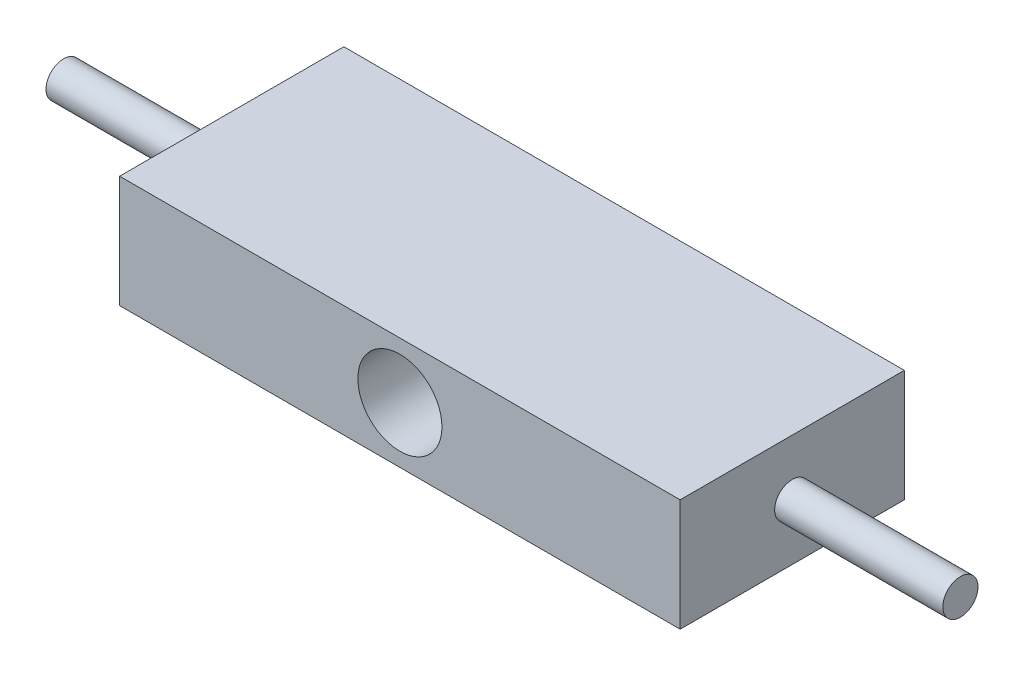
ISO-10303-21;
HEADER;
FILE_DESCRIPTION(('STEP AP214'),'2;1');
FILE_NAME('part.step','',(''),(''),'','','');
FILE_SCHEMA(('AUTOMOTIVE_DESIGN { 1 0 10303 214 1 1 1 1 }'));
ENDSEC;
DATA;
#1=APPLICATION_CONTEXT('core data for automotive mechanical design processes');
#2=APPLICATION_PROTOCOL_DEFINITION('international standard','automotive_design',2000,#1);
#3=PRODUCT_CONTEXT('',#1,'mechanical');
#4=PRODUCT('Part','Part','',(#3));
#5=PRODUCT_RELATED_PRODUCT_CATEGORY('part','',(#4));
#6=PRODUCT_DEFINITION_FORMATION('','',#4);
#7=PRODUCT_DEFINITION_CONTEXT('part definition',#1,'design');
#8=PRODUCT_DEFINITION('design','',#6,#7);
#9=PRODUCT_DEFINITION_SHAPE('','',#8);
#10=(LENGTH_UNIT() NAMED_UNIT(*) SI_UNIT(.MILLI.,.METRE.));
#11=(NAMED_UNIT(*) PLANE_ANGLE_UNIT() SI_UNIT($,.RADIAN.));
#12=(NAMED_UNIT(*) SI_UNIT($,.STERADIAN.) SOLID_ANGLE_UNIT());
#13=UNCERTAINTY_MEASURE_WITH_UNIT(LENGTH_MEASURE(1.E-05),#10,'distance_accuracy_value','');
#14=(GEOMETRIC_REPRESENTATION_CONTEXT(3) GLOBAL_UNCERTAINTY_ASSIGNED_CONTEXT((#13)) GLOBAL_UNIT_ASSIGNED_CONTEXT((#10,
#11,#12)) REPRESENTATION_CONTEXT('',''));
#15=CARTESIAN_POINT('',(0.,0.,0.));
#16=DIRECTION('',(0.,0.,1.));
#17=DIRECTION('',(1.,0.,0.));
#18=AXIS2_PLACEMENT_3D('',#15,#16,#17);
#19=CARTESIAN_POINT('',(31.75,6.35,-25.4));
#20=DIRECTION('',(1.,0.,0.));
#21=DIRECTION('',(0.,0.,-1.));
#22=AXIS2_PLACEMENT_3D('',#19,#20,#21);
#23=PLANE('',#22);
#24=CARTESIAN_POINT('',(31.75,0.,-12.7));
#25=DIRECTION('',(1.,0.,0.));
#26=DIRECTION('',(0.,0.,-1.));
#27=AXIS2_PLACEMENT_3D('',#24,#25,#26);
#28=CIRCLE('',#27,1.9939);
#29=CARTESIAN_POINT('',(31.75,0.,-14.6939));
#30=VERTEX_POINT('',#29);
#31=EDGE_CURVE('E161',#30,#30,#28,.T.);
#32=ORIENTED_EDGE('',*,*,#31,.F.);
#33=EDGE_LOOP('',(#32));
#34=FACE_BOUND('',#33,.T.);
#35=DIRECTION('',(0.,1.,0.));
#36=VECTOR('',#35,1.);
#37=CARTESIAN_POINT('',(31.75,6.35,0.));
#38=LINE('',#37,#36);
#39=CARTESIAN_POINT('',(31.75,-6.35,0.));
#40=VERTEX_POINT('',#39);
#41=CARTESIAN_POINT('',(31.75,6.35,0.));
#42=VERTEX_POINT('',#41);
#43=EDGE_CURVE('E103',#40,#42,#38,.T.);
#44=ORIENTED_EDGE('',*,*,#43,.F.);
#45=DIRECTION('',(0.,0.,1.));
#46=VECTOR('',#45,1.);
#47=CARTESIAN_POINT('',(31.75,-6.35,-25.4));
#48=LINE('',#47,#46);
#49=CARTESIAN_POINT('',(31.75,-6.35,-25.4));
#50=VERTEX_POINT('',#49);
#51=EDGE_CURVE('E11',#50,#40,#48,.T.);
#52=ORIENTED_EDGE('',*,*,#51,.F.);
#53=DIRECTION('',(0.,1.,0.));
#54=VECTOR('',#53,1.);
#55=CARTESIAN_POINT('',(31.75,6.35,-25.4));
#56=LINE('',#55,#54);
#57=CARTESIAN_POINT('',(31.75,6.35,-25.4));
#58=VERTEX_POINT('',#57);
#59=EDGE_CURVE('E96',#50,#58,#56,.T.);
#60=ORIENTED_EDGE('',*,*,#59,.T.);
#61=DIRECTION('',(0.,0.,1.));
#62=VECTOR('',#61,1.);
#63=CARTESIAN_POINT('',(31.75,6.35,-25.4));
#64=LINE('',#63,#62);
#65=EDGE_CURVE('E41',#58,#42,#64,.T.);
#66=ORIENTED_EDGE('',*,*,#65,.T.);
#67=EDGE_LOOP('',(#44,#52,#60,#66));
#68=FACE_BOUND('',#67,.T.);
#69=ADVANCED_FACE('F38',(#34,#68),#23,.T.);
#70=CARTESIAN_POINT('',(-31.75,-6.35,-25.4));
#71=DIRECTION('',(0.,-1.,0.));
#72=DIRECTION('',(0.,0.,-1.));
#73=AXIS2_PLACEMENT_3D('',#70,#71,#72);
#74=PLANE('',#73);
#75=DIRECTION('',(1.,0.,0.));
#76=VECTOR('',#75,1.);
#77=CARTESIAN_POINT('',(-31.75,-6.35,0.));
#78=LINE('',#77,#76);
#79=CARTESIAN_POINT('',(-31.75,-6.35,0.));
#80=VERTEX_POINT('',#79);
#81=EDGE_CURVE('E98',#80,#40,#78,.T.);
#82=ORIENTED_EDGE('',*,*,#81,.F.);
#83=DIRECTION('',(0.,0.,1.));
#84=VECTOR('',#83,1.);
#85=CARTESIAN_POINT('',(-31.75,-6.35,-25.4));
#86=LINE('',#85,#84);
#87=CARTESIAN_POINT('',(-31.75,-6.35,-25.4));
#88=VERTEX_POINT('',#87);
#89=EDGE_CURVE('E47',#88,#80,#86,.T.);
#90=ORIENTED_EDGE('',*,*,#89,.F.);
#91=DIRECTION('',(1.,0.,0.));
#92=VECTOR('',#91,1.);
#93=CARTESIAN_POINT('',(-31.75,-6.35,-25.4));
#94=LINE('',#93,#92);
#95=EDGE_CURVE('E93',#88,#50,#94,.T.);
#96=ORIENTED_EDGE('',*,*,#95,.T.);
#97=ORIENTED_EDGE('',*,*,#51,.T.);
#98=EDGE_LOOP('',(#82,#90,#96,#97));
#99=FACE_BOUND('',#98,.T.);
#100=ADVANCED_FACE('F114',(#99),#74,.T.);
#101=CARTESIAN_POINT('',(-31.75,6.35,-25.4));
#102=DIRECTION('',(-1.,0.,0.));
#103=DIRECTION('',(0.,0.,1.));
#104=AXIS2_PLACEMENT_3D('',#101,#102,#103);
#105=PLANE('',#104);
#106=CARTESIAN_POINT('',(-31.75,0.,-12.7));
#107=DIRECTION('',(-1.,0.,0.));
#108=DIRECTION('',(0.,0.,1.));
#109=AXIS2_PLACEMENT_3D('',#106,#107,#108);
#110=CIRCLE('',#109,1.9939);
#111=CARTESIAN_POINT('',(-31.75,0.,-10.7061));
#112=VERTEX_POINT('',#111);
#113=EDGE_CURVE('E162',#112,#112,#110,.T.);
#114=ORIENTED_EDGE('',*,*,#113,.F.);
#115=EDGE_LOOP('',(#114));
#116=FACE_BOUND('',#115,.T.);
#117=DIRECTION('',(0.,-1.,0.));
#118=VECTOR('',#117,1.);
#119=CARTESIAN_POINT('',(-31.75,6.35,0.));
#120=LINE('',#119,#118);
#121=CARTESIAN_POINT('',(-31.75,6.35,0.));
#122=VERTEX_POINT('',#121);
#123=EDGE_CURVE('E88',#122,#80,#120,.T.);
#124=ORIENTED_EDGE('',*,*,#123,.F.);
#125=DIRECTION('',(0.,0.,1.));
#126=VECTOR('',#125,1.);
#127=CARTESIAN_POINT('',(-31.75,6.35,-25.4));
#128=LINE('',#127,#126);
#129=CARTESIAN_POINT('',(-31.75,6.35,-25.4));
#130=VERTEX_POINT('',#129);
#131=EDGE_CURVE('E83',#130,#122,#128,.T.);
#132=ORIENTED_EDGE('',*,*,#131,.F.);
#133=DIRECTION('',(0.,-1.,0.));
#134=VECTOR('',#133,1.);
#135=CARTESIAN_POINT('',(-31.75,6.35,-25.4));
#136=LINE('',#135,#134);
#137=EDGE_CURVE('E86',#130,#88,#136,.T.);
#138=ORIENTED_EDGE('',*,*,#137,.T.);
#139=ORIENTED_EDGE('',*,*,#89,.T.);
#140=EDGE_LOOP('',(#124,#132,#138,#139));
#141=FACE_BOUND('',#140,.T.);
#142=ADVANCED_FACE('F85',(#116,#141),#105,.T.);
#143=CARTESIAN_POINT('',(-31.75,6.35,-25.4));
#144=DIRECTION('',(0.,1.,0.));
#145=DIRECTION('',(0.,0.,1.));
#146=AXIS2_PLACEMENT_3D('',#143,#144,#145);
#147=PLANE('',#146);
#148=DIRECTION('',(-1.,0.,0.));
#149=VECTOR('',#148,1.);
#150=CARTESIAN_POINT('',(-31.75,6.35,0.));
#151=LINE('',#150,#149);
#152=EDGE_CURVE('E106',#42,#122,#151,.T.);
#153=ORIENTED_EDGE('',*,*,#152,.F.);
#154=ORIENTED_EDGE('',*,*,#65,.F.);
#155=DIRECTION('',(-1.,0.,0.));
#156=VECTOR('',#155,1.);
#157=CARTESIAN_POINT('',(-31.75,6.35,-25.4));
#158=LINE('',#157,#156);
#159=EDGE_CURVE('E92',#58,#130,#158,.T.);
#160=ORIENTED_EDGE('',*,*,#159,.T.);
#161=ORIENTED_EDGE('',*,*,#131,.T.);
#162=EDGE_LOOP('',(#153,#154,#160,#161));
#163=FACE_BOUND('',#162,.T.);
#164=ADVANCED_FACE('F95',(#163),#147,.T.);
#165=CARTESIAN_POINT('',(0.,0.,-25.4));
#166=DIRECTION('',(0.,0.,1.));
#167=DIRECTION('',(1.,0.,0.));
#168=AXIS2_PLACEMENT_3D('',#165,#166,#167);
#169=PLANE('',#168);
#170=CARTESIAN_POINT('',(0.,0.,-25.4));
#171=DIRECTION('',(0.,0.,1.));
#172=DIRECTION('',(1.,0.,0.));
#173=AXIS2_PLACEMENT_3D('',#170,#171,#172);
#174=CIRCLE('',#173,4.7625);
#175=CARTESIAN_POINT('',(4.76249999999999,0.,-25.4));
#176=VERTEX_POINT('',#175);
#177=EDGE_CURVE('E107',#176,#176,#174,.T.);
#178=ORIENTED_EDGE('',*,*,#177,.T.);
#179=EDGE_LOOP('',(#178));
#180=FACE_BOUND('',#179,.T.);
#181=ORIENTED_EDGE('',*,*,#59,.F.);
#182=ORIENTED_EDGE('',*,*,#95,.F.);
#183=ORIENTED_EDGE('',*,*,#137,.F.);
#184=ORIENTED_EDGE('',*,*,#159,.F.);
#185=EDGE_LOOP('',(#181,#182,#183,#184));
#186=FACE_BOUND('',#185,.T.);
#187=ADVANCED_FACE('F91',(#180,#186),#169,.F.);
#188=CARTESIAN_POINT('',(0.,0.,0.));
#189=DIRECTION('',(0.,0.,1.));
#190=DIRECTION('',(1.,0.,0.));
#191=AXIS2_PLACEMENT_3D('',#188,#189,#190);
#192=PLANE('',#191);
#193=CARTESIAN_POINT('',(0.,0.,0.));
#194=DIRECTION('',(0.,0.,1.));
#195=DIRECTION('',(1.,0.,0.));
#196=AXIS2_PLACEMENT_3D('',#193,#194,#195);
#197=CIRCLE('',#196,4.7625);
#198=CARTESIAN_POINT('',(4.76249999999999,0.,0.));
#199=VERTEX_POINT('',#198);
#200=EDGE_CURVE('E171',#199,#199,#197,.T.);
#201=ORIENTED_EDGE('',*,*,#200,.F.);
#202=EDGE_LOOP('',(#201));
#203=FACE_BOUND('',#202,.T.);
#204=ORIENTED_EDGE('',*,*,#43,.T.);
#205=ORIENTED_EDGE('',*,*,#152,.T.);
#206=ORIENTED_EDGE('',*,*,#123,.T.);
#207=ORIENTED_EDGE('',*,*,#81,.T.);
#208=EDGE_LOOP('',(#204,#205,#206,#207));
#209=FACE_BOUND('',#208,.T.);
#210=ADVANCED_FACE('F113',(#203,#209),#192,.T.);
#211=CARTESIAN_POINT('',(0.,0.,-25.4));
#212=DIRECTION('',(0.,0.,1.));
#213=DIRECTION('',(1.,0.,0.));
#214=AXIS2_PLACEMENT_3D('',#211,#212,#213);
#215=CYLINDRICAL_SURFACE('',#214,4.7625);
#216=ORIENTED_EDGE('',*,*,#177,.F.);
#217=EDGE_LOOP('',(#216));
#218=FACE_BOUND('',#217,.T.);
#219=ORIENTED_EDGE('',*,*,#200,.T.);
#220=EDGE_LOOP('',(#219));
#221=FACE_BOUND('',#220,.T.);
#222=ADVANCED_FACE('F134',(#218,#221),#215,.F.);
#223=CARTESIAN_POINT('',(50.8,0.,-12.7));
#224=DIRECTION('',(-1.,0.,0.));
#225=DIRECTION('',(0.,0.,1.));
#226=AXIS2_PLACEMENT_3D('',#223,#224,#225);
#227=CYLINDRICAL_SURFACE('',#226,1.9939);
#228=CARTESIAN_POINT('',(50.8,0.,-12.7));
#229=DIRECTION('',(1.,0.,0.));
#230=DIRECTION('',(0.,0.,-1.));
#231=AXIS2_PLACEMENT_3D('',#228,#229,#230);
#232=CIRCLE('',#231,1.9939);
#233=CARTESIAN_POINT('',(50.8,0.,-14.6939));
#234=VERTEX_POINT('',#233);
#235=EDGE_CURVE('E165',#234,#234,#232,.T.);
#236=ORIENTED_EDGE('',*,*,#235,.F.);
#237=EDGE_LOOP('',(#236));
#238=FACE_BOUND('',#237,.T.);
#239=ORIENTED_EDGE('',*,*,#31,.T.);
#240=EDGE_LOOP('',(#239));
#241=FACE_BOUND('',#240,.T.);
#242=ADVANCED_FACE('F140',(#238,#241),#227,.T.);
#243=CARTESIAN_POINT('',(50.8,0.,0.));
#244=DIRECTION('',(1.,0.,0.));
#245=DIRECTION('',(0.,0.,-1.));
#246=AXIS2_PLACEMENT_3D('',#243,#244,#245);
#247=PLANE('',#246);
#248=ORIENTED_EDGE('',*,*,#235,.T.);
#249=EDGE_LOOP('',(#248));
#250=FACE_BOUND('',#249,.T.);
#251=ADVANCED_FACE('F144',(#250),#247,.T.);
#252=CARTESIAN_POINT('',(-50.8,0.,-12.7));
#253=DIRECTION('',(1.,0.,0.));
#254=DIRECTION('',(0.,0.,-1.));
#255=AXIS2_PLACEMENT_3D('',#252,#253,#254);
#256=CYLINDRICAL_SURFACE('',#255,1.9939);
#257=CARTESIAN_POINT('',(-50.8,0.,-12.7));
#258=DIRECTION('',(-1.,0.,0.));
#259=DIRECTION('',(0.,0.,1.));
#260=AXIS2_PLACEMENT_3D('',#257,#258,#259);
#261=CIRCLE('',#260,1.9939);
#262=CARTESIAN_POINT('',(-50.8,0.,-10.7061));
#263=VERTEX_POINT('',#262);
#264=EDGE_CURVE('E160',#263,#263,#261,.T.);
#265=ORIENTED_EDGE('',*,*,#264,.F.);
#266=EDGE_LOOP('',(#265));
#267=FACE_BOUND('',#266,.T.);
#268=ORIENTED_EDGE('',*,*,#113,.T.);
#269=EDGE_LOOP('',(#268));
#270=FACE_BOUND('',#269,.T.);
#271=ADVANCED_FACE('F148',(#267,#270),#256,.T.);
#272=CARTESIAN_POINT('',(-50.8,0.,-12.7));
#273=DIRECTION('',(-1.,0.,0.));
#274=DIRECTION('',(0.,0.,1.));
#275=AXIS2_PLACEMENT_3D('',#272,#273,#274);
#276=PLANE('',#275);
#277=ORIENTED_EDGE('',*,*,#264,.T.);
#278=EDGE_LOOP('',(#277));
#279=FACE_BOUND('',#278,.T.);
#280=ADVANCED_FACE('F152',(#279),#276,.T.);
#281=CLOSED_SHELL('',(#69,#100,#142,#164,#187,#210,#222,#242,#251,#271,#280));
#282=MANIFOLD_SOLID_BREP('B2',#281);
#283=ADVANCED_BREP_SHAPE_REPRESENTATION('',(#18,#282),#14);
#284=SHAPE_DEFINITION_REPRESENTATION(#9,#283);
ENDSEC;
END-ISO-10303-21;
